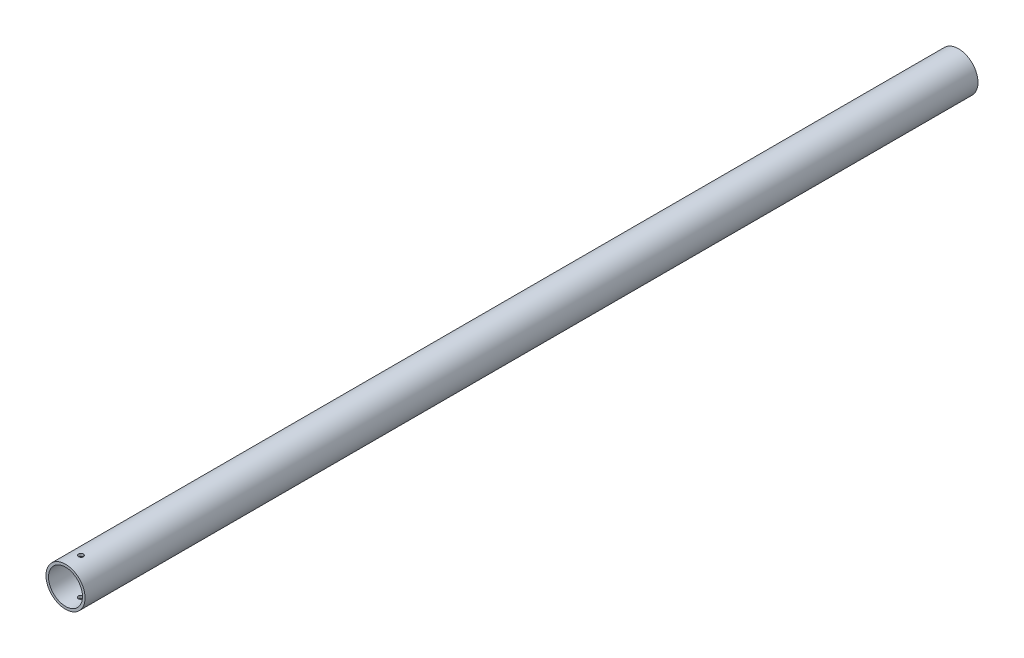
ISO-10303-21;
HEADER;
FILE_DESCRIPTION(('STEP AP214'),'2;1');
FILE_NAME('part.step','',(''),(''),'','','');
FILE_SCHEMA(('AUTOMOTIVE_DESIGN { 1 0 10303 214 1 1 1 1 }'));
ENDSEC;
DATA;
#1=APPLICATION_CONTEXT('core data for automotive mechanical design processes');
#2=APPLICATION_PROTOCOL_DEFINITION('international standard','automotive_design',2000,#1);
#3=PRODUCT_CONTEXT('',#1,'mechanical');
#4=PRODUCT('Part','Part','',(#3));
#5=PRODUCT_RELATED_PRODUCT_CATEGORY('part','',(#4));
#6=PRODUCT_DEFINITION_FORMATION('','',#4);
#7=PRODUCT_DEFINITION_CONTEXT('part definition',#1,'design');
#8=PRODUCT_DEFINITION('design','',#6,#7);
#9=PRODUCT_DEFINITION_SHAPE('','',#8);
#10=(LENGTH_UNIT() NAMED_UNIT(*) SI_UNIT(.MILLI.,.METRE.));
#11=(NAMED_UNIT(*) PLANE_ANGLE_UNIT() SI_UNIT($,.RADIAN.));
#12=(NAMED_UNIT(*) SI_UNIT($,.STERADIAN.) SOLID_ANGLE_UNIT());
#13=UNCERTAINTY_MEASURE_WITH_UNIT(LENGTH_MEASURE(1.E-05),#10,'distance_accuracy_value','');
#14=(GEOMETRIC_REPRESENTATION_CONTEXT(3) GLOBAL_UNCERTAINTY_ASSIGNED_CONTEXT((#13)) GLOBAL_UNIT_ASSIGNED_CONTEXT((#10,
#11,#12)) REPRESENTATION_CONTEXT('',''));
#15=CARTESIAN_POINT('',(0.,0.,0.));
#16=DIRECTION('',(0.,0.,1.));
#17=DIRECTION('',(1.,0.,0.));
#18=AXIS2_PLACEMENT_3D('',#15,#16,#17);
#19=CARTESIAN_POINT('',(0.,0.,580.));
#20=DIRECTION('',(0.,0.,1.));
#21=DIRECTION('',(1.,0.,0.));
#22=AXIS2_PLACEMENT_3D('',#19,#20,#21);
#23=PLANE('',#22);
#24=CARTESIAN_POINT('',(0.,0.,580.));
#25=DIRECTION('',(0.,0.,1.));
#26=DIRECTION('',(1.,0.,0.));
#27=AXIS2_PLACEMENT_3D('',#24,#25,#26);
#28=CIRCLE('',#27,12.7);
#29=CARTESIAN_POINT('',(12.7,0.,580.));
#30=VERTEX_POINT('',#29);
#31=EDGE_CURVE('E10',#30,#30,#28,.T.);
#32=ORIENTED_EDGE('',*,*,#31,.T.);
#33=EDGE_LOOP('',(#32));
#34=FACE_BOUND('',#33,.T.);
#35=CARTESIAN_POINT('',(0.,0.,580.));
#36=DIRECTION('',(0.,0.,1.));
#37=DIRECTION('',(1.,0.,0.));
#38=AXIS2_PLACEMENT_3D('',#35,#36,#37);
#39=CIRCLE('',#38,11.049);
#40=CARTESIAN_POINT('',(11.049,0.,580.));
#41=VERTEX_POINT('',#40);
#42=EDGE_CURVE('E58',#41,#41,#39,.T.);
#43=ORIENTED_EDGE('',*,*,#42,.F.);
#44=EDGE_LOOP('',(#43));
#45=FACE_BOUND('',#44,.T.);
#46=ADVANCED_FACE('F37',(#34,#45),#23,.T.);
#47=CARTESIAN_POINT('',(0.,0.,0.));
#48=DIRECTION('',(0.,0.,1.));
#49=DIRECTION('',(1.,0.,0.));
#50=AXIS2_PLACEMENT_3D('',#47,#48,#49);
#51=PLANE('',#50);
#52=CARTESIAN_POINT('',(0.,0.,0.));
#53=DIRECTION('',(0.,0.,1.));
#54=DIRECTION('',(1.,0.,0.));
#55=AXIS2_PLACEMENT_3D('',#52,#53,#54);
#56=CIRCLE('',#55,12.7);
#57=CARTESIAN_POINT('',(12.7,0.,0.));
#58=VERTEX_POINT('',#57);
#59=EDGE_CURVE('E52',#58,#58,#56,.T.);
#60=ORIENTED_EDGE('',*,*,#59,.F.);
#61=EDGE_LOOP('',(#60));
#62=FACE_BOUND('',#61,.T.);
#63=CARTESIAN_POINT('',(0.,0.,0.));
#64=DIRECTION('',(0.,0.,1.));
#65=DIRECTION('',(1.,0.,0.));
#66=AXIS2_PLACEMENT_3D('',#63,#64,#65);
#67=CIRCLE('',#66,11.049);
#68=CARTESIAN_POINT('',(11.049,0.,0.));
#69=VERTEX_POINT('',#68);
#70=EDGE_CURVE('E61',#69,#69,#67,.T.);
#71=ORIENTED_EDGE('',*,*,#70,.T.);
#72=EDGE_LOOP('',(#71));
#73=FACE_BOUND('',#72,.T.);
#74=ADVANCED_FACE('F102',(#62,#73),#51,.F.);
#75=CARTESIAN_POINT('',(0.,0.,580.));
#76=DIRECTION('',(0.,0.,-1.));
#77=DIRECTION('',(-1.,0.,0.));
#78=AXIS2_PLACEMENT_3D('',#75,#76,#77);
#79=CYLINDRICAL_SURFACE('',#78,12.7);
#80=CARTESIAN_POINT('',(0.,-12.7,571.6));
#81=CARTESIAN_POINT('',(0.0894924179248788,-12.6999987434099,571.599996201636));
#82=CARTESIAN_POINT('',(0.179040614412608,-12.6990440804374,571.592466346499));
#83=CARTESIAN_POINT('',(0.355644785211786,-12.6953275709422,571.562547369634));
#84=CARTESIAN_POINT('',(0.44269806494703,-12.6925638420658,571.540142770217));
#85=CARTESIAN_POINT('',(0.611730160392031,-12.6855405221026,571.481145220858));
#86=CARTESIAN_POINT('',(0.693712363584373,-12.6812819425516,571.444561863661));
#87=CARTESIAN_POINT('',(0.850358261378941,-12.6717424510449,571.35826633385));
#88=CARTESIAN_POINT('',(0.925023199765711,-12.6664617132908,571.30855639781));
#89=CARTESIAN_POINT('',(1.06534783196157,-12.655434411631,571.19712182373));
#90=CARTESIAN_POINT('',(1.13096073934991,-12.6496856551215,571.135338480641));
#91=CARTESIAN_POINT('',(1.25091583898465,-12.6383878969334,571.001636944026));
#92=CARTESIAN_POINT('',(1.30525745423939,-12.6328389054931,570.929718231975));
#93=CARTESIAN_POINT('',(1.40130195439882,-12.6225473765476,570.777483061863));
#94=CARTESIAN_POINT('',(1.4429609543456,-12.6178076636342,570.697138709571));
#95=CARTESIAN_POINT('',(1.51217740796592,-12.60970028443,570.530524623618));
#96=CARTESIAN_POINT('',(1.53973540467326,-12.6063325653044,570.444255118281));
#97=CARTESIAN_POINT('',(1.57982530130084,-12.6013714350206,570.268725408808));
#98=CARTESIAN_POINT('',(1.59243623917851,-12.5997686941271,570.179483524751));
#99=CARTESIAN_POINT('',(1.60251862000441,-12.5984904414851,570.000136763178));
#100=CARTESIAN_POINT('',(1.59999068107671,-12.5988148510506,569.910031921047));
#101=CARTESIAN_POINT('',(1.57993193783677,-12.6013457074957,569.732068090746));
#102=CARTESIAN_POINT('',(1.56248823221416,-12.6035412280183,569.644199107988));
#103=CARTESIAN_POINT('',(1.51322902954859,-12.6095498823158,569.472645568348));
#104=CARTESIAN_POINT('',(1.48141323711336,-12.6133630493384,569.38896109751));
#105=CARTESIAN_POINT('',(1.40421948602912,-12.6221897236085,569.227881698306));
#106=CARTESIAN_POINT('',(1.35880371257966,-12.6272065698563,569.150505082281));
#107=CARTESIAN_POINT('',(1.25572623427734,-12.6378727524514,569.004438507454));
#108=CARTESIAN_POINT('',(1.19806396048831,-12.6435221181777,568.935748952464));
#109=CARTESIAN_POINT('',(1.0716477641472,-12.654865355151,568.808500823188));
#110=CARTESIAN_POINT('',(1.00281877399884,-12.6605592602684,568.750016802906));
#111=CARTESIAN_POINT('',(0.856281320649885,-12.6713128940237,568.645420500963));
#112=CARTESIAN_POINT('',(0.778572836419546,-12.6763726211596,568.599308248604));
#113=CARTESIAN_POINT('',(0.616424501627402,-12.6852910155623,568.520764247544));
#114=CARTESIAN_POINT('',(0.531982346739229,-12.6891492694388,568.488337206148));
#115=CARTESIAN_POINT('',(0.358792122779273,-12.6952262565842,568.438143500836));
#116=CARTESIAN_POINT('',(0.270044258712634,-12.6974450678295,568.420376139663));
#117=CARTESIAN_POINT('',(0.091406430560578,-12.6999830260959,568.400102863411));
#118=CARTESIAN_POINT('',(0.00152829555289477,-12.7003149556609,568.397494253776));
#119=CARTESIAN_POINT('',(-0.177383878672366,-12.699076273538,568.407341460323));
#120=CARTESIAN_POINT('',(-0.26641793611459,-12.6975057030222,568.419796950503));
#121=CARTESIAN_POINT('',(-0.440811296295214,-12.692646460056,568.459333475456));
#122=CARTESIAN_POINT('',(-0.526181882888352,-12.6893635454965,568.486365505713));
#123=CARTESIAN_POINT('',(-0.69117807270776,-12.6814471380545,568.554236795673));
#124=CARTESIAN_POINT('',(-0.770803477946196,-12.6768135986552,568.595076530935));
#125=CARTESIAN_POINT('',(-0.92250741464724,-12.6666806052371,568.689652131012));
#126=CARTESIAN_POINT('',(-0.99454426236179,-12.6611767457519,568.743454378488));
#127=CARTESIAN_POINT('',(-1.12860203677896,-12.6499324712923,568.862333894764));
#128=CARTESIAN_POINT('',(-1.19062255918989,-12.6441920467813,568.92741161846));
#129=CARTESIAN_POINT('',(-1.30325184296854,-12.6330821472209,569.06744730716));
#130=CARTESIAN_POINT('',(-1.3537925024322,-12.6277150105589,569.142460258433));
#131=CARTESIAN_POINT('',(-1.441556815448,-12.6179979363878,569.29997042014));
#132=CARTESIAN_POINT('',(-1.47878073950968,-12.6136479782168,569.382467478503));
#133=CARTESIAN_POINT('',(-1.53874484743711,-12.6064737364848,569.552384930052));
#134=CARTESIAN_POINT('',(-1.56152333516262,-12.603645421149,569.639791628252));
#135=CARTESIAN_POINT('',(-1.5920732731043,-12.5998231585706,569.81722731093));
#136=CARTESIAN_POINT('',(-1.59984543339557,-12.5988291245328,569.907256171127));
#137=CARTESIAN_POINT('',(-1.60014892658518,-12.5987905270514,570.086703018506));
#138=CARTESIAN_POINT('',(-1.59278725324331,-12.5997322779157,570.176120840631));
#139=CARTESIAN_POINT('',(-1.56325871841078,-12.6034297030422,570.35243741047));
#140=CARTESIAN_POINT('',(-1.54109185611484,-12.6061853774031,570.439336158047));
#141=CARTESIAN_POINT('',(-1.48261579325464,-12.6131959008124,570.608133197984));
#142=CARTESIAN_POINT('',(-1.44631183124396,-12.6174501944863,570.690033329612));
#143=CARTESIAN_POINT('',(-1.36060263367834,-12.6269795118494,570.846596484829));
#144=CARTESIAN_POINT('',(-1.31119722371342,-12.6322545491266,570.921259412056));
#145=CARTESIAN_POINT('',(-1.2002909085571,-12.643275660654,571.061775567265));
#146=CARTESIAN_POINT('',(-1.13871027844508,-12.6490246856494,571.127565643193));
#147=CARTESIAN_POINT('',(-1.00536796775963,-12.6603200010424,571.247919249231));
#148=CARTESIAN_POINT('',(-0.933603891566837,-12.6658662433488,571.30248013029));
#149=CARTESIAN_POINT('',(-0.781613629386237,-12.6761547673552,571.399006311796));
#150=CARTESIAN_POINT('',(-0.701355837212738,-12.6808938618779,571.440922161111));
#151=CARTESIAN_POINT('',(-0.534925317109745,-12.6890018606354,571.510621322515));
#152=CARTESIAN_POINT('',(-0.448759121281383,-12.6923722503951,571.538419964983));
#153=CARTESIAN_POINT('',(-0.30179105697051,-12.6965521804402,571.572454057632));
#154=CARTESIAN_POINT('',(-0.241915288916301,-12.6978388015125,571.582768906236));
#155=CARTESIAN_POINT('',(-0.121368229355303,-12.6995631342266,571.596543139688));
#156=CARTESIAN_POINT('',(-0.0606969438455509,-12.7000008522642,571.600002576186));
#157=CARTESIAN_POINT('',(0.,-12.7,571.6));
#158=B_SPLINE_CURVE_WITH_KNOTS('',3,(#80,#81,#82,#83,#84,#85,#86,#87,#88,#89,#90,#91,#92,#93,
#94,#95,#96,#97,#98,#99,#100,#101,#102,#103,#104,#105,#106,#107,#108,#109,#110,#111,#112,#113,
#114,#115,#116,#117,#118,#119,#120,#121,#122,#123,#124,#125,#126,#127,#128,#129,#130,#131,#132,
#133,#134,#135,#136,#137,#138,#139,#140,#141,#142,#143,#144,#145,#146,#147,#148,#149,#150,#151,
#152,#153,#154,#155,#156,#157),.UNSPECIFIED.,.T.,.F.,(4,2,2,2,2,2,2,2,2,2,2,2,2,2,2,2,2,2,2,2,2,
2,2,2,2,2,2,2,2,2,2,2,2,2,2,2,2,2,4),(0.,0.268255543853637,0.536790655295484,0.805144403526742,
1.0734524577333,1.34309912383255,1.61275959007976,1.88334281118339,2.15391561126293,
2.4230511847368,2.69217576941386,2.95973948466272,3.22730869945037,3.49562891073937,
3.7639615901191,4.03417916128036,4.3043973724248,4.57470845495597,4.84500667993418,
5.11347158670022,5.3819306837252,5.64949283080081,5.91706419408211,6.18603609267788,
6.45501884514841,6.72555786849614,6.9960913959368,7.26590453736944,7.5357049113684,
7.80360440124779,8.07150390569888,8.33930423333671,8.60710812618321,8.87672746106246,
9.14641032840395,9.41713457054277,9.68756419151459,9.86950602227708,10.0514464822525),.UNSPECIFIED.);
#159=CARTESIAN_POINT('',(0.,-12.7,571.6));
#160=VERTEX_POINT('',#159);
#161=EDGE_CURVE('E88',#160,#160,#158,.T.);
#162=ORIENTED_EDGE('',*,*,#161,.T.);
#163=EDGE_LOOP('',(#162));
#164=FACE_BOUND('',#163,.T.);
#165=CARTESIAN_POINT('',(0.,12.7,571.6));
#166=CARTESIAN_POINT('',(-0.0894924179248269,12.6999987434099,571.599996201636));
#167=CARTESIAN_POINT('',(-0.179040614412555,12.6990440804374,571.592466346499));
#168=CARTESIAN_POINT('',(-0.355644785211736,12.6953275709422,571.562547369634));
#169=CARTESIAN_POINT('',(-0.442698064946982,12.6925638420658,571.540142770217));
#170=CARTESIAN_POINT('',(-0.611730160391984,12.6855405221026,571.481145220858));
#171=CARTESIAN_POINT('',(-0.693712363584323,12.6812819425516,571.444561863661));
#172=CARTESIAN_POINT('',(-0.850358261378899,12.6717424510449,571.35826633385));
#173=CARTESIAN_POINT('',(-0.92502319976568,12.6664617132908,571.30855639781));
#174=CARTESIAN_POINT('',(-1.06534783196153,12.655434411631,571.19712182373));
#175=CARTESIAN_POINT('',(-1.13096073934986,12.6496856551215,571.135338480641));
#176=CARTESIAN_POINT('',(-1.2509158389846,12.6383878969335,571.001636944026));
#177=CARTESIAN_POINT('',(-1.30525745423934,12.6328389054931,570.929718231975));
#178=CARTESIAN_POINT('',(-1.40130195439875,12.6225473765477,570.777483061863));
#179=CARTESIAN_POINT('',(-1.44296095434551,12.6178076636342,570.697138709571));
#180=CARTESIAN_POINT('',(-1.51217740796582,12.60970028443,570.530524623618));
#181=CARTESIAN_POINT('',(-1.53973540467316,12.6063325653044,570.444255118281));
#182=CARTESIAN_POINT('',(-1.57982530130074,12.6013714350206,570.268725408808));
#183=CARTESIAN_POINT('',(-1.59243623917841,12.5997686941271,570.179483524751));
#184=CARTESIAN_POINT('',(-1.60251862000431,12.5984904414851,570.000136763178));
#185=CARTESIAN_POINT('',(-1.59999068107661,12.5988148510506,569.910031921047));
#186=CARTESIAN_POINT('',(-1.57993193783667,12.6013457074957,569.732068090746));
#187=CARTESIAN_POINT('',(-1.56248823221406,12.6035412280183,569.644199107988));
#188=CARTESIAN_POINT('',(-1.51322902954848,12.6095498823158,569.472645568347));
#189=CARTESIAN_POINT('',(-1.48141323711323,12.6133630493384,569.38896109751));
#190=CARTESIAN_POINT('',(-1.40421948602897,12.6221897236085,569.227881698306));
#191=CARTESIAN_POINT('',(-1.35880371257952,12.6272065698564,569.15050508228));
#192=CARTESIAN_POINT('',(-1.25572623427723,12.6378727524514,569.004438507454));
#193=CARTESIAN_POINT('',(-1.19806396048821,12.6435221181778,568.935748952464));
#194=CARTESIAN_POINT('',(-1.07164776414708,12.654865355151,568.808500823188));
#195=CARTESIAN_POINT('',(-1.00281877399869,12.6605592602684,568.750016802906));
#196=CARTESIAN_POINT('',(-0.856281320649689,12.6713128940237,568.645420500963));
#197=CARTESIAN_POINT('',(-0.778572836419322,12.6763726211596,568.599308248604));
#198=CARTESIAN_POINT('',(-0.616424501627154,12.6852910155623,568.520764247544));
#199=CARTESIAN_POINT('',(-0.531982346738992,12.6891492694388,568.488337206148));
#200=CARTESIAN_POINT('',(-0.35879212277907,12.6952262565842,568.438143500836));
#201=CARTESIAN_POINT('',(-0.270044258712454,12.6974450678295,568.420376139663));
#202=CARTESIAN_POINT('',(-0.0914064305604193,12.6999830260959,568.400102863411));
#203=CARTESIAN_POINT('',(-0.00152829555273351,12.7003149556609,568.397494253776));
#204=CARTESIAN_POINT('',(0.177383878672531,12.699076273538,568.407341460323));
#205=CARTESIAN_POINT('',(0.266417936114757,12.6975057030222,568.419796950503));
#206=CARTESIAN_POINT('',(0.440811296295366,12.692646460056,568.459333475456));
#207=CARTESIAN_POINT('',(0.526181882888489,12.6893635454965,568.486365505713));
#208=CARTESIAN_POINT('',(0.691178072707901,12.6814471380545,568.554236795673));
#209=CARTESIAN_POINT('',(0.770803477946356,12.6768135986552,568.595076530935));
#210=CARTESIAN_POINT('',(0.922507414647382,12.6666806052371,568.689652131012));
#211=CARTESIAN_POINT('',(0.994544262361903,12.6611767457518,568.743454378488));
#212=CARTESIAN_POINT('',(1.12860203677906,12.6499324712923,568.862333894764));
#213=CARTESIAN_POINT('',(1.19062255918999,12.6441920467813,568.92741161846));
#214=CARTESIAN_POINT('',(1.30325184296866,12.6330821472209,569.06744730716));
#215=CARTESIAN_POINT('',(1.35379250243234,12.6277150105589,569.142460258433));
#216=CARTESIAN_POINT('',(1.44155681544815,12.6179979363878,569.29997042014));
#217=CARTESIAN_POINT('',(1.47878073950982,12.6136479782167,569.382467478503));
#218=CARTESIAN_POINT('',(1.53874484743725,12.6064737364848,569.552384930052));
#219=CARTESIAN_POINT('',(1.56152333516275,12.603645421149,569.639791628252));
#220=CARTESIAN_POINT('',(1.59207327310441,12.5998231585706,569.81722731093));
#221=CARTESIAN_POINT('',(1.59984543339567,12.5988291245328,569.907256171127));
#222=CARTESIAN_POINT('',(1.60014892658529,12.5987905270514,570.086703018506));
#223=CARTESIAN_POINT('',(1.59278725324341,12.5997322779157,570.176120840631));
#224=CARTESIAN_POINT('',(1.56325871841088,12.6034297030421,570.35243741047));
#225=CARTESIAN_POINT('',(1.54109185611493,12.6061853774031,570.439336158047));
#226=CARTESIAN_POINT('',(1.48261579325468,12.6131959008124,570.608133197985));
#227=CARTESIAN_POINT('',(1.44631183124396,12.6174501944863,570.690033329612));
#228=CARTESIAN_POINT('',(1.36060263367833,12.6269795118494,570.846596484829));
#229=CARTESIAN_POINT('',(1.31119722371343,12.6322545491266,570.921259412056));
#230=CARTESIAN_POINT('',(1.20029090855714,12.643275660654,571.061775567265));
#231=CARTESIAN_POINT('',(1.13871027844512,12.6490246856494,571.127565643193));
#232=CARTESIAN_POINT('',(1.00536796775971,12.6603200010424,571.247919249231));
#233=CARTESIAN_POINT('',(0.933603891566922,12.6658662433488,571.30248013029));
#234=CARTESIAN_POINT('',(0.78161362938633,12.6761547673552,571.399006311796));
#235=CARTESIAN_POINT('',(0.701355837212826,12.6808938618779,571.440922161111));
#236=CARTESIAN_POINT('',(0.534925317109823,12.6890018606354,571.510621322515));
#237=CARTESIAN_POINT('',(0.448759121281457,12.6923722503951,571.538419964983));
#238=CARTESIAN_POINT('',(0.301791056970577,12.6965521804402,571.572454057632));
#239=CARTESIAN_POINT('',(0.241915288916364,12.6978388015125,571.582768906236));
#240=CARTESIAN_POINT('',(0.121368229355361,12.6995631342266,571.596543139688));
#241=CARTESIAN_POINT('',(0.0606969438456053,12.7000008522642,571.600002576186));
#242=CARTESIAN_POINT('',(0.,12.7,571.6));
#243=B_SPLINE_CURVE_WITH_KNOTS('',3,(#165,#166,#167,#168,#169,#170,#171,#172,#173,#174,#175,
#176,#177,#178,#179,#180,#181,#182,#183,#184,#185,#186,#187,#188,#189,#190,#191,#192,#193,#194,
#195,#196,#197,#198,#199,#200,#201,#202,#203,#204,#205,#206,#207,#208,#209,#210,#211,#212,#213,
#214,#215,#216,#217,#218,#219,#220,#221,#222,#223,#224,#225,#226,#227,#228,#229,#230,#231,#232,
#233,#234,#235,#236,#237,#238,#239,#240,#241,#242),.UNSPECIFIED.,.T.,.F.,(4,2,2,2,2,2,2,2,2,2,2,
2,2,2,2,2,2,2,2,2,2,2,2,2,2,2,2,2,2,2,2,2,2,2,2,2,2,2,4),(0.,0.268255543853636,
0.536790655295488,0.805144403526745,1.07345245773332,1.34309912383254,1.61275959007986,
1.88334281118336,2.1539156112629,2.42305118473677,2.69217576941383,2.95973948466269,
3.22730869945046,3.49562891073935,3.76396159011906,4.03417916128037,4.30439737242496,
4.57470845495603,4.8450066799342,5.11347158670024,5.38193068372522,5.64949283080079,
5.91706419408214,6.18603609267776,6.4550188451484,6.72555786849625,6.99609139593689,
7.26590453736953,7.53570491136837,7.80360440124777,8.07150390569898,8.33930423333683,
8.60710812618332,8.87672746106245,9.14641032840393,9.41713457054275,9.68756419151459,
9.86950602227708,10.0514464822525),.UNSPECIFIED.);
#244=CARTESIAN_POINT('',(0.,12.7,571.6));
#245=VERTEX_POINT('',#244);
#246=EDGE_CURVE('E82',#245,#245,#243,.T.);
#247=ORIENTED_EDGE('',*,*,#246,.T.);
#248=EDGE_LOOP('',(#247));
#249=FACE_BOUND('',#248,.T.);
#250=ORIENTED_EDGE('',*,*,#31,.F.);
#251=EDGE_LOOP('',(#250));
#252=FACE_BOUND('',#251,.T.);
#253=ORIENTED_EDGE('',*,*,#59,.T.);
#254=EDGE_LOOP('',(#253));
#255=FACE_BOUND('',#254,.T.);
#256=ADVANCED_FACE('F39',(#164,#249,#252,#255),#79,.T.);
#257=CARTESIAN_POINT('',(0.,0.,580.));
#258=DIRECTION('',(0.,0.,-1.));
#259=DIRECTION('',(-1.,0.,0.));
#260=AXIS2_PLACEMENT_3D('',#257,#258,#259);
#261=CYLINDRICAL_SURFACE('',#260,11.049);
#262=CARTESIAN_POINT('',(0.,-11.049,571.6));
#263=CARTESIAN_POINT('',(0.0893712582851404,-11.0489986028468,571.599996287567));
#264=CARTESIAN_POINT('',(0.178795263946458,-11.0479042800509,571.592486706793));
#265=CARTESIAN_POINT('',(0.355146222489126,-11.0436441158968,571.562652990979));
#266=CARTESIAN_POINT('',(0.442070616004656,-11.0404762250872,571.540314198887));
#267=CARTESIAN_POINT('',(0.6108444760869,-11.032425120452,571.481501450163));
#268=CARTESIAN_POINT('',(0.692697634227252,-11.0275431720419,571.445037919176));
#269=CARTESIAN_POINT('',(0.849110171156899,-11.016604184771,571.35903566953));
#270=CARTESIAN_POINT('',(0.923670613274337,-11.0105473176067,571.309498860953));
#271=CARTESIAN_POINT('',(1.06393877637276,-10.9978831859306,571.198370602638));
#272=CARTESIAN_POINT('',(1.12958554197195,-10.9912725871394,571.136702585784));
#273=CARTESIAN_POINT('',(1.24963716710825,-10.9782723173064,571.003227156207));
#274=CARTESIAN_POINT('',(1.30404139722256,-10.9718826586507,570.931419176168));
#275=CARTESIAN_POINT('',(1.40029875254454,-10.9600153094697,570.779295445197));
#276=CARTESIAN_POINT('',(1.44209329653994,-10.9545419265142,570.69894226145));
#277=CARTESIAN_POINT('',(1.51157058030488,-10.9451720833278,570.532264342955));
#278=CARTESIAN_POINT('',(1.53925403654856,-10.9412755430365,570.445939911644));
#279=CARTESIAN_POINT('',(1.5795348583209,-10.9355331773788,570.270409324894));
#280=CARTESIAN_POINT('',(1.59223629400852,-10.9336732118387,570.181227522461));
#281=CARTESIAN_POINT('',(1.60251484610889,-10.932171596269,570.001980427171));
#282=CARTESIAN_POINT('',(1.60009277273166,-10.9325298274043,569.9119151819));
#283=CARTESIAN_POINT('',(1.58027819171026,-10.9354111955971,569.734190773632));
#284=CARTESIAN_POINT('',(1.56300130751063,-10.9379176116315,569.646518409699));
#285=CARTESIAN_POINT('',(1.51414839663446,-10.9447868307112,569.475330294501));
#286=CARTESIAN_POINT('',(1.48257199070878,-10.9491496829925,569.391814653546));
#287=CARTESIAN_POINT('',(1.405895230138,-10.959258773088,569.230957252135));
#288=CARTESIAN_POINT('',(1.36074561944871,-10.9650100340901,569.153639299425));
#289=CARTESIAN_POINT('',(1.25823919356808,-10.9772442382938,569.007633273979));
#290=CARTESIAN_POINT('',(1.20088163094825,-10.9837272262837,568.938945730047));
#291=CARTESIAN_POINT('',(1.07495143682248,-10.9967684009013,568.811479971088));
#292=CARTESIAN_POINT('',(1.00627933882951,-11.0033267255927,568.752799993848));
#293=CARTESIAN_POINT('',(0.860009196297847,-11.0157234607055,568.647783320883));
#294=CARTESIAN_POINT('',(0.782411117328087,-11.0215618683496,568.601446672775));
#295=CARTESIAN_POINT('',(0.620408674643769,-11.0318664507279,568.522428046087));
#296=CARTESIAN_POINT('',(0.536000719628259,-11.0363318953564,568.489753329252));
#297=CARTESIAN_POINT('',(0.362816730884106,-11.0433812185558,568.439069829404));
#298=CARTESIAN_POINT('',(0.274040972569546,-11.0459652156004,568.421060122934));
#299=CARTESIAN_POINT('',(0.0954895976747313,-11.0489448728389,568.400347767346));
#300=CARTESIAN_POINT('',(0.00572996515573768,-11.0493598488559,568.397510002047));
#301=CARTESIAN_POINT('',(-0.172983816485285,-11.0480071922475,568.406863901358));
#302=CARTESIAN_POINT('',(-0.261937988725932,-11.0462396224677,568.419055133212));
#303=CARTESIAN_POINT('',(-0.436108847811435,-11.0407324361875,568.458008625505));
#304=CARTESIAN_POINT('',(-0.521340492039235,-11.0370016891171,568.484705369073));
#305=CARTESIAN_POINT('',(-0.686117809772372,-11.0279852461049,568.551843188863));
#306=CARTESIAN_POINT('',(-0.765663231946037,-11.0226994814839,568.59228487216));
#307=CARTESIAN_POINT('',(-0.917406318193027,-11.0111127456836,568.686083768355));
#308=CARTESIAN_POINT('',(-0.989550249955035,-11.0048051055132,568.739527067922));
#309=CARTESIAN_POINT('',(-1.12389317446277,-10.9918983042316,568.857691857599));
#310=CARTESIAN_POINT('',(-1.18609163016953,-10.9852991274025,568.922413956353));
#311=CARTESIAN_POINT('',(-1.29926695319771,-10.9724921331706,569.061899267985));
#312=CARTESIAN_POINT('',(-1.35015346436902,-10.9662877311145,569.136736154706));
#313=CARTESIAN_POINT('',(-1.43863321930338,-10.9550323213184,569.2939745689));
#314=CARTESIAN_POINT('',(-1.47622680269892,-10.9499812841111,569.376375903034));
#315=CARTESIAN_POINT('',(-1.53691211867381,-10.9416289309212,569.546129811351));
#316=CARTESIAN_POINT('',(-1.56005215155827,-10.9383217930796,569.633464819668));
#317=CARTESIAN_POINT('',(-1.59132766971789,-10.9338159451507,569.810832721997));
#318=CARTESIAN_POINT('',(-1.59946411482938,-10.9326171001881,569.900865443052));
#319=CARTESIAN_POINT('',(-1.60047981477524,-10.9324683755945,570.080172881429));
#320=CARTESIAN_POINT('',(-1.59350110697184,-10.9334975590963,570.16944680944));
#321=CARTESIAN_POINT('',(-1.56478818036122,-10.9376435357861,570.345537440338));
#322=CARTESIAN_POINT('',(-1.54305397896072,-10.9407603265115,570.432354146123));
#323=CARTESIAN_POINT('',(-1.48549598808944,-10.9487232011081,570.60103111579));
#324=CARTESIAN_POINT('',(-1.44968144953931,-10.9535681493694,570.682894593323));
#325=CARTESIAN_POINT('',(-1.36499348094369,-10.9644429156517,570.83947363932));
#326=CARTESIAN_POINT('',(-1.31611966966714,-10.9704727682615,570.914188999025));
#327=CARTESIAN_POINT('',(-1.20618192340795,-10.9831054996293,571.055073632302));
#328=CARTESIAN_POINT('',(-1.14501261502333,-10.9897130316383,571.1211602704));
#329=CARTESIAN_POINT('',(-1.01244273061104,-11.0027172667011,571.24218194596));
#330=CARTESIAN_POINT('',(-0.941039773331443,-11.0091139202587,571.297114380759));
#331=CARTESIAN_POINT('',(-0.789601755856391,-11.0210128156133,571.394517119308));
#332=CARTESIAN_POINT('',(-0.709524426480901,-11.0265103170677,571.436922268247));
#333=CARTESIAN_POINT('',(-0.54334393314429,-11.0359447805551,571.507618595837));
#334=CARTESIAN_POINT('',(-0.457247187113316,-11.0398833757233,571.535924553108));
#335=CARTESIAN_POINT('',(-0.30895871635534,-11.0448459117293,571.571118100819));
#336=CARTESIAN_POINT('',(-0.247687065811507,-11.0463957868278,571.581932483807));
#337=CARTESIAN_POINT('',(-0.124285441483466,-11.0484733110861,571.596374684139));
#338=CARTESIAN_POINT('',(-0.0621554773121846,-11.0490009716851,571.600002581904));
#339=CARTESIAN_POINT('',(0.,-11.049,571.6));
#340=B_SPLINE_CURVE_WITH_KNOTS('',3,(#262,#263,#264,#265,#266,#267,#268,#269,#270,#271,#272,
#273,#274,#275,#276,#277,#278,#279,#280,#281,#282,#283,#284,#285,#286,#287,#288,#289,#290,#291,
#292,#293,#294,#295,#296,#297,#298,#299,#300,#301,#302,#303,#304,#305,#306,#307,#308,#309,#310,
#311,#312,#313,#314,#315,#316,#317,#318,#319,#320,#321,#322,#323,#324,#325,#326,#327,#328,#329,
#330,#331,#332,#333,#334,#335,#336,#337,#338,#339),.UNSPECIFIED.,.T.,.F.,(4,2,2,2,2,2,2,2,2,2,2,
2,2,2,2,2,2,2,2,2,2,2,2,2,2,2,2,2,2,2,2,2,2,2,2,2,2,2,4),(0.,0.267886672257117,
0.536038516165588,0.803992809837385,1.07190797550582,1.34157174894815,1.61125061565602,
1.88216370116319,2.15306303000205,2.4220693069674,2.69106117261389,2.95797808183896,
3.22490207059688,3.49280664337717,3.76072762326181,4.03114362673034,4.30156067333641,
4.57212127292171,4.84266483397945,5.11079496238424,5.37891737026735,5.64583869971233,
5.91277181982537,6.18152291507278,6.45028851753004,6.72112939990339,6.99196336182924,
7.26188735009823,7.53179406970837,7.79917548287627,8.06655658062085,8.3337622991325,
8.60097581886317,8.87058530910049,9.14025763651331,9.41130879542528,9.68207524040738,
9.86838581311024,10.0546943008638),.UNSPECIFIED.);
#341=CARTESIAN_POINT('',(0.,-11.049,571.6));
#342=VERTEX_POINT('',#341);
#343=EDGE_CURVE('E42',#342,#342,#340,.T.);
#344=ORIENTED_EDGE('',*,*,#343,.F.);
#345=EDGE_LOOP('',(#344));
#346=FACE_BOUND('',#345,.T.);
#347=CARTESIAN_POINT('',(0.,11.049,571.6));
#348=CARTESIAN_POINT('',(-0.0893712582850376,11.0489986028468,571.599996287567));
#349=CARTESIAN_POINT('',(-0.178795263946355,11.0479042800509,571.592486706793));
#350=CARTESIAN_POINT('',(-0.355146222489023,11.0436441158968,571.562652990979));
#351=CARTESIAN_POINT('',(-0.442070616004553,11.0404762250872,571.540314198887));
#352=CARTESIAN_POINT('',(-0.610844476086797,11.032425120452,571.481501450163));
#353=CARTESIAN_POINT('',(-0.692697634227149,11.0275431720419,571.445037919176));
#354=CARTESIAN_POINT('',(-0.849110171156796,11.016604184771,571.35903566953));
#355=CARTESIAN_POINT('',(-0.923670613274234,11.0105473176067,571.309498860953));
#356=CARTESIAN_POINT('',(-1.06393877637266,10.9978831859306,571.198370602638));
#357=CARTESIAN_POINT('',(-1.12958554197185,10.9912725871394,571.136702585784));
#358=CARTESIAN_POINT('',(-1.24963716710815,10.9782723173064,571.003227156207));
#359=CARTESIAN_POINT('',(-1.30404139722245,10.9718826586507,570.931419176168));
#360=CARTESIAN_POINT('',(-1.40029875254444,10.9600153094697,570.779295445197));
#361=CARTESIAN_POINT('',(-1.44209329653983,10.9545419265142,570.69894226145));
#362=CARTESIAN_POINT('',(-1.51157058030478,10.9451720833278,570.532264342955));
#363=CARTESIAN_POINT('',(-1.53925403654846,10.9412755430365,570.445939911644));
#364=CARTESIAN_POINT('',(-1.5795348583208,10.9355331773788,570.270409324894));
#365=CARTESIAN_POINT('',(-1.59223629400842,10.9336732118387,570.181227522461));
#366=CARTESIAN_POINT('',(-1.60251484610878,10.932171596269,570.001980427171));
#367=CARTESIAN_POINT('',(-1.60009277273156,10.9325298274043,569.9119151819));
#368=CARTESIAN_POINT('',(-1.58027819171015,10.9354111955972,569.734190773632));
#369=CARTESIAN_POINT('',(-1.56300130751053,10.9379176116315,569.646518409699));
#370=CARTESIAN_POINT('',(-1.51414839663435,10.9447868307112,569.475330294501));
#371=CARTESIAN_POINT('',(-1.48257199070868,10.9491496829925,569.391814653546));
#372=CARTESIAN_POINT('',(-1.40589523013789,10.959258773088,569.230957252135));
#373=CARTESIAN_POINT('',(-1.3607456194486,10.9650100340901,569.153639299425));
#374=CARTESIAN_POINT('',(-1.25823919356797,10.9772442382938,569.007633273979));
#375=CARTESIAN_POINT('',(-1.20088163094814,10.9837272262837,568.938945730047));
#376=CARTESIAN_POINT('',(-1.07495143682238,10.9967684009013,568.811479971088));
#377=CARTESIAN_POINT('',(-1.0062793388294,11.0033267255927,568.752799993848));
#378=CARTESIAN_POINT('',(-0.860009196297744,11.0157234607055,568.647783320883));
#379=CARTESIAN_POINT('',(-0.782411117327984,11.0215618683496,568.601446672775));
#380=CARTESIAN_POINT('',(-0.620408674643666,11.031866450728,568.522428046087));
#381=CARTESIAN_POINT('',(-0.536000719628156,11.0363318953564,568.489753329252));
#382=CARTESIAN_POINT('',(-0.362816730884003,11.0433812185558,568.439069829404));
#383=CARTESIAN_POINT('',(-0.274040972569443,11.0459652156004,568.421060122934));
#384=CARTESIAN_POINT('',(-0.0954895976746281,11.0489448728389,568.400347767346));
#385=CARTESIAN_POINT('',(-0.00572996515563456,11.0493598488559,568.397510002047));
#386=CARTESIAN_POINT('',(0.172983816485388,11.0480071922475,568.406863901358));
#387=CARTESIAN_POINT('',(0.261937988726035,11.0462396224677,568.419055133212));
#388=CARTESIAN_POINT('',(0.436108847811538,11.0407324361875,568.458008625505));
#389=CARTESIAN_POINT('',(0.521340492039339,11.0370016891171,568.484705369073));
#390=CARTESIAN_POINT('',(0.686117809772473,11.0279852461049,568.551843188863));
#391=CARTESIAN_POINT('',(0.765663231946134,11.0226994814839,568.59228487216));
#392=CARTESIAN_POINT('',(0.917406318193148,11.0111127456836,568.686083768355));
#393=CARTESIAN_POINT('',(0.989550249955183,11.0048051055132,568.739527067922));
#394=CARTESIAN_POINT('',(1.12389317446292,10.9918983042316,568.857691857599));
#395=CARTESIAN_POINT('',(1.18609163016964,10.9852991274024,568.922413956353));
#396=CARTESIAN_POINT('',(1.29926695319781,10.9724921331706,569.061899267985));
#397=CARTESIAN_POINT('',(1.35015346436912,10.9662877311145,569.136736154706));
#398=CARTESIAN_POINT('',(1.43863321930349,10.9550323213184,569.2939745689));
#399=CARTESIAN_POINT('',(1.47622680269903,10.9499812841111,569.376375903034));
#400=CARTESIAN_POINT('',(1.53691211867391,10.9416289309211,569.546129811351));
#401=CARTESIAN_POINT('',(1.56005215155838,10.9383217930796,569.633464819668));
#402=CARTESIAN_POINT('',(1.591327669718,10.9338159451507,569.810832721997));
#403=CARTESIAN_POINT('',(1.59946411482948,10.9326171001881,569.900865443052));
#404=CARTESIAN_POINT('',(1.60047981477534,10.9324683755945,570.080172881429));
#405=CARTESIAN_POINT('',(1.59350110697194,10.9334975590963,570.16944680944));
#406=CARTESIAN_POINT('',(1.56478818036132,10.9376435357861,570.345537440338));
#407=CARTESIAN_POINT('',(1.54305397896082,10.9407603265115,570.432354146123));
#408=CARTESIAN_POINT('',(1.48549598808955,10.9487232011081,570.60103111579));
#409=CARTESIAN_POINT('',(1.44968144953942,10.9535681493694,570.682894593323));
#410=CARTESIAN_POINT('',(1.36499348094379,10.9644429156517,570.83947363932));
#411=CARTESIAN_POINT('',(1.31611966966725,10.9704727682615,570.914188999025));
#412=CARTESIAN_POINT('',(1.20618192340805,10.9831054996293,571.055073632302));
#413=CARTESIAN_POINT('',(1.14501261502343,10.9897130316382,571.1211602704));
#414=CARTESIAN_POINT('',(1.01244273061114,11.0027172667011,571.24218194596));
#415=CARTESIAN_POINT('',(0.941039773331546,11.0091139202587,571.297114380759));
#416=CARTESIAN_POINT('',(0.789601755856494,11.0210128156133,571.394517119308));
#417=CARTESIAN_POINT('',(0.709524426481003,11.0265103170677,571.436922268247));
#418=CARTESIAN_POINT('',(0.543343933144393,11.035944780555,571.507618595837));
#419=CARTESIAN_POINT('',(0.457247187113419,11.0398833757233,571.535924553108));
#420=CARTESIAN_POINT('',(0.308958716355443,11.0448459117293,571.571118100819));
#421=CARTESIAN_POINT('',(0.24768706581161,11.0463957868278,571.581932483807));
#422=CARTESIAN_POINT('',(0.124285441483569,11.0484733110861,571.596374684139));
#423=CARTESIAN_POINT('',(0.0621554773122872,11.0490009716851,571.600002581904));
#424=CARTESIAN_POINT('',(0.,11.049,571.6));
#425=B_SPLINE_CURVE_WITH_KNOTS('',3,(#347,#348,#349,#350,#351,#352,#353,#354,#355,#356,#357,
#358,#359,#360,#361,#362,#363,#364,#365,#366,#367,#368,#369,#370,#371,#372,#373,#374,#375,#376,
#377,#378,#379,#380,#381,#382,#383,#384,#385,#386,#387,#388,#389,#390,#391,#392,#393,#394,#395,
#396,#397,#398,#399,#400,#401,#402,#403,#404,#405,#406,#407,#408,#409,#410,#411,#412,#413,#414,
#415,#416,#417,#418,#419,#420,#421,#422,#423,#424),.UNSPECIFIED.,.T.,.F.,(4,2,2,2,2,2,2,2,2,2,2,
2,2,2,2,2,2,2,2,2,2,2,2,2,2,2,2,2,2,2,2,2,2,2,2,2,2,2,4),(0.,0.267886672257117,
0.536038516165587,0.803992809837384,1.07190797550582,1.34157174894815,1.61125061565602,
1.88216370116319,2.15306303000205,2.4220693069674,2.69106117261389,2.95797808183896,
3.22490207059688,3.49280664337717,3.76072762326181,4.03114362673034,4.30156067333641,
4.57212127292171,4.84266483397945,5.11079496238424,5.37891737026735,5.64583869971233,
5.91277181982537,6.18152291507283,6.45028851753004,6.7211293999034,6.99196336182925,
7.26188735009824,7.53179406970838,7.79917548287627,8.06655658062086,8.33376229913251,
8.60097581886317,8.8705853091005,9.14025763651332,9.41130879542529,9.68207524040739,
9.86838581311025,10.0546943008638),.UNSPECIFIED.);
#426=CARTESIAN_POINT('',(0.,11.049,571.6));
#427=VERTEX_POINT('',#426);
#428=EDGE_CURVE('E63',#427,#427,#425,.T.);
#429=ORIENTED_EDGE('',*,*,#428,.F.);
#430=EDGE_LOOP('',(#429));
#431=FACE_BOUND('',#430,.T.);
#432=ORIENTED_EDGE('',*,*,#42,.T.);
#433=EDGE_LOOP('',(#432));
#434=FACE_BOUND('',#433,.T.);
#435=ORIENTED_EDGE('',*,*,#70,.F.);
#436=EDGE_LOOP('',(#435));
#437=FACE_BOUND('',#436,.T.);
#438=ADVANCED_FACE('F69',(#346,#431,#434,#437),#261,.F.);
#439=CARTESIAN_POINT('',(0.,-12.7,570.));
#440=DIRECTION('',(0.,1.,0.));
#441=DIRECTION('',(0.,0.,1.));
#442=AXIS2_PLACEMENT_3D('',#439,#440,#441);
#443=CYLINDRICAL_SURFACE('',#442,1.60000000000006);
#444=ORIENTED_EDGE('',*,*,#428,.T.);
#445=EDGE_LOOP('',(#444));
#446=FACE_BOUND('',#445,.T.);
#447=ORIENTED_EDGE('',*,*,#246,.F.);
#448=EDGE_LOOP('',(#447));
#449=FACE_BOUND('',#448,.T.);
#450=ADVANCED_FACE('F75',(#446,#449),#443,.F.);
#451=ORIENTED_EDGE('',*,*,#343,.T.);
#452=EDGE_LOOP('',(#451));
#453=FACE_BOUND('',#452,.T.);
#454=ORIENTED_EDGE('',*,*,#161,.F.);
#455=EDGE_LOOP('',(#454));
#456=FACE_BOUND('',#455,.T.);
#457=ADVANCED_FACE('F72',(#453,#456),#443,.F.);
#458=CLOSED_SHELL('',(#46,#74,#256,#438,#450,#457));
#459=MANIFOLD_SOLID_BREP('B2',#458);
#460=ADVANCED_BREP_SHAPE_REPRESENTATION('',(#18,#459),#14);
#461=SHAPE_DEFINITION_REPRESENTATION(#9,#460);
ENDSEC;
END-ISO-10303-21;
